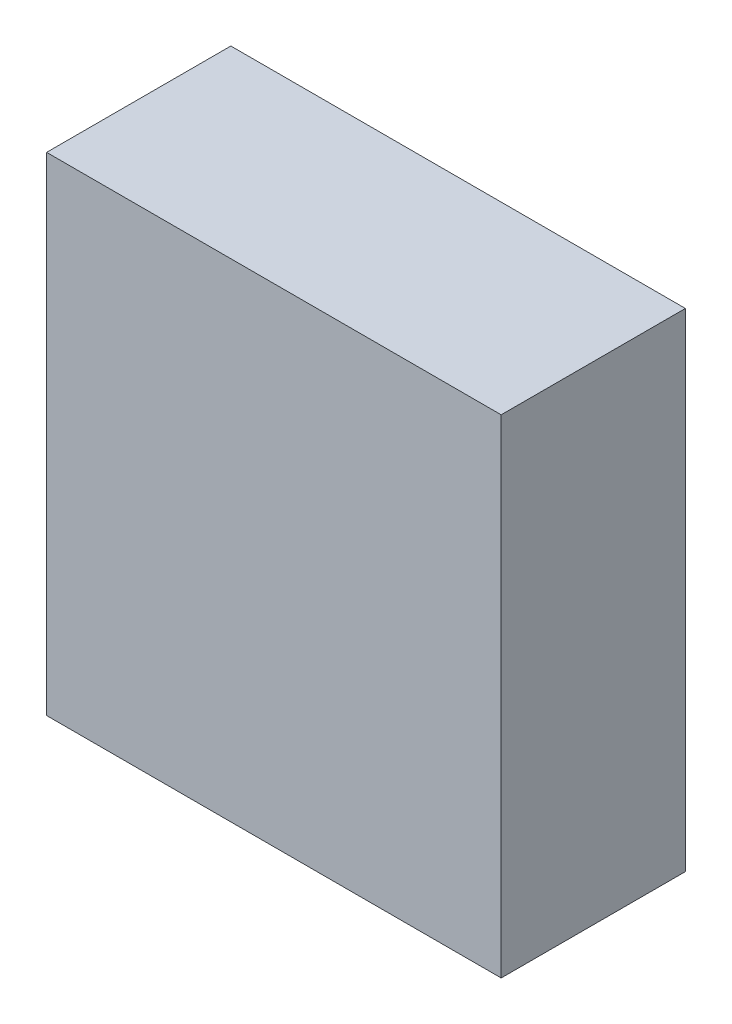
ISO-10303-21;
HEADER;
FILE_DESCRIPTION(('STEP AP214'),'2;1');
FILE_NAME('part.step','',(''),(''),'','','');
FILE_SCHEMA(('AUTOMOTIVE_DESIGN { 1 0 10303 214 1 1 1 1 }'));
ENDSEC;
DATA;
#1=APPLICATION_CONTEXT('core data for automotive mechanical design processes');
#2=APPLICATION_PROTOCOL_DEFINITION('international standard','automotive_design',2000,#1);
#3=PRODUCT_CONTEXT('',#1,'mechanical');
#4=PRODUCT('Part','Part','',(#3));
#5=PRODUCT_RELATED_PRODUCT_CATEGORY('part','',(#4));
#6=PRODUCT_DEFINITION_FORMATION('','',#4);
#7=PRODUCT_DEFINITION_CONTEXT('part definition',#1,'design');
#8=PRODUCT_DEFINITION('design','',#6,#7);
#9=PRODUCT_DEFINITION_SHAPE('','',#8);
#10=(LENGTH_UNIT() NAMED_UNIT(*) SI_UNIT(.MILLI.,.METRE.));
#11=(NAMED_UNIT(*) PLANE_ANGLE_UNIT() SI_UNIT($,.RADIAN.));
#12=(NAMED_UNIT(*) SI_UNIT($,.STERADIAN.) SOLID_ANGLE_UNIT());
#13=UNCERTAINTY_MEASURE_WITH_UNIT(LENGTH_MEASURE(1.E-05),#10,'distance_accuracy_value','');
#14=(GEOMETRIC_REPRESENTATION_CONTEXT(3) GLOBAL_UNCERTAINTY_ASSIGNED_CONTEXT((#13)) GLOBAL_UNIT_ASSIGNED_CONTEXT((#10,
#11,#12)) REPRESENTATION_CONTEXT('',''));
#15=CARTESIAN_POINT('',(0.,0.,0.));
#16=DIRECTION('',(0.,0.,1.));
#17=DIRECTION('',(1.,0.,0.));
#18=AXIS2_PLACEMENT_3D('',#15,#16,#17);
#19=CARTESIAN_POINT('',(-1.60001644388223,3.2699992416654,-4.61112093925476));
#20=DIRECTION('',(-1.,8.74227765734759E-08,0.));
#21=DIRECTION('',(-8.74227765734759E-08,-1.,0.));
#22=AXIS2_PLACEMENT_3D('',#19,#20,#21);
#23=PLANE('',#22);
#24=DIRECTION('',(-8.7422776579626E-08,-0.999999999999996,0.));
#25=VECTOR('',#24,1.);
#26=CARTESIAN_POINT('',(-1.60001644388223,3.2699992416654,-4.61112093925476));
#27=LINE('',#26,#25);
#28=CARTESIAN_POINT('',(-1.60001644388223,3.2699992416654,-4.61112093925476));
#29=VERTEX_POINT('',#28);
#30=CARTESIAN_POINT('',(-1.60001701562726,-3.27000167386194,-4.61112093925476));
#31=VERTEX_POINT('',#30);
#32=EDGE_CURVE('E11',#29,#31,#27,.T.);
#33=ORIENTED_EDGE('',*,*,#32,.T.);
#34=DIRECTION('',(0.,0.,1.));
#35=VECTOR('',#34,1.);
#36=CARTESIAN_POINT('',(-1.60001701562726,-3.27000167386194,-4.61112093925476));
#37=LINE('',#36,#35);
#38=CARTESIAN_POINT('',(-1.60001701562726,-3.27000167386194,-2.14112091064453));
#39=VERTEX_POINT('',#38);
#40=EDGE_CURVE('E88',#31,#39,#37,.T.);
#41=ORIENTED_EDGE('',*,*,#40,.T.);
#42=DIRECTION('',(-8.7422776579626E-08,-0.999999999999996,0.));
#43=VECTOR('',#42,1.);
#44=CARTESIAN_POINT('',(-1.60001644388223,3.2699992416654,-2.14112091064453));
#45=LINE('',#44,#43);
#46=CARTESIAN_POINT('',(-1.60001644388223,3.2699992416654,-2.14112091064453));
#47=VERTEX_POINT('',#46);
#48=EDGE_CURVE('E83',#47,#39,#45,.T.);
#49=ORIENTED_EDGE('',*,*,#48,.F.);
#50=DIRECTION('',(0.,0.,1.));
#51=VECTOR('',#50,1.);
#52=CARTESIAN_POINT('',(-1.60001644388223,3.26999924166541,-4.61112093925476));
#53=LINE('',#52,#51);
#54=EDGE_CURVE('E72',#29,#47,#53,.T.);
#55=ORIENTED_EDGE('',*,*,#54,.F.);
#56=EDGE_LOOP('',(#33,#41,#49,#55));
#57=FACE_BOUND('',#56,.T.);
#58=ADVANCED_FACE('F17',(#57),#23,.T.);
#59=CARTESIAN_POINT('',(-1.60001701562726,-3.27000167386194,-4.61112093925476));
#60=DIRECTION('',(-8.74227765734759E-08,-1.,0.));
#61=DIRECTION('',(1.,-8.74227765734759E-08,0.));
#62=AXIS2_PLACEMENT_3D('',#59,#60,#61);
#63=PLANE('',#62);
#64=DIRECTION('',(0.999999999999996,-8.74227766065619E-08,0.));
#65=VECTOR('',#64,1.);
#66=CARTESIAN_POINT('',(-1.60001701562726,-3.27000167386194,-4.61112093925476));
#67=LINE('',#66,#65);
#68=CARTESIAN_POINT('',(4.49498420507587,-3.27000220670386,-4.61112093925476));
#69=VERTEX_POINT('',#68);
#70=EDGE_CURVE('E24',#31,#69,#67,.T.);
#71=ORIENTED_EDGE('',*,*,#70,.T.);
#72=DIRECTION('',(0.,0.,1.));
#73=VECTOR('',#72,1.);
#74=CARTESIAN_POINT('',(4.49498420507587,-3.27000220670387,-4.61112093925476));
#75=LINE('',#74,#73);
#76=CARTESIAN_POINT('',(4.49498420507587,-3.27000220670386,-2.14112091064453));
#77=VERTEX_POINT('',#76);
#78=EDGE_CURVE('E85',#69,#77,#75,.T.);
#79=ORIENTED_EDGE('',*,*,#78,.T.);
#80=DIRECTION('',(0.999999999999996,-8.74227766065619E-08,0.));
#81=VECTOR('',#80,1.);
#82=CARTESIAN_POINT('',(-1.60001701562726,-3.27000167386194,-2.14112091064453));
#83=LINE('',#82,#81);
#84=EDGE_CURVE('E66',#39,#77,#83,.T.);
#85=ORIENTED_EDGE('',*,*,#84,.F.);
#86=ORIENTED_EDGE('',*,*,#40,.F.);
#87=EDGE_LOOP('',(#71,#79,#85,#86));
#88=FACE_BOUND('',#87,.T.);
#89=ADVANCED_FACE('F89',(#88),#63,.T.);
#90=CARTESIAN_POINT('',(4.49498420507587,-3.27000220670386,-4.61112093925476));
#91=DIRECTION('',(1.,-8.74227765734759E-08,0.));
#92=DIRECTION('',(8.74227765734759E-08,1.,0.));
#93=AXIS2_PLACEMENT_3D('',#90,#91,#92);
#94=PLANE('',#93);
#95=DIRECTION('',(8.7422776579626E-08,0.999999999999996,0.));
#96=VECTOR('',#95,1.);
#97=CARTESIAN_POINT('',(4.49498420507587,-3.27000220670386,-4.61112093925476));
#98=LINE('',#97,#96);
#99=CARTESIAN_POINT('',(4.4949847768209,3.26999870882348,-4.61112093925476));
#100=VERTEX_POINT('',#99);
#101=EDGE_CURVE('E62',#69,#100,#98,.T.);
#102=ORIENTED_EDGE('',*,*,#101,.T.);
#103=DIRECTION('',(0.,0.,1.));
#104=VECTOR('',#103,1.);
#105=CARTESIAN_POINT('',(4.4949847768209,3.26999870882348,-4.61112093925476));
#106=LINE('',#105,#104);
#107=CARTESIAN_POINT('',(4.4949847768209,3.26999870882348,-2.14112091064453));
#108=VERTEX_POINT('',#107);
#109=EDGE_CURVE('E55',#100,#108,#106,.T.);
#110=ORIENTED_EDGE('',*,*,#109,.T.);
#111=DIRECTION('',(8.7422776579626E-08,0.999999999999996,0.));
#112=VECTOR('',#111,1.);
#113=CARTESIAN_POINT('',(4.49498420507587,-3.27000220670386,-2.14112091064453));
#114=LINE('',#113,#112);
#115=EDGE_CURVE('E59',#77,#108,#114,.T.);
#116=ORIENTED_EDGE('',*,*,#115,.F.);
#117=ORIENTED_EDGE('',*,*,#78,.F.);
#118=EDGE_LOOP('',(#102,#110,#116,#117));
#119=FACE_BOUND('',#118,.T.);
#120=ADVANCED_FACE('F57',(#119),#94,.T.);
#121=CARTESIAN_POINT('',(4.4949847768209,3.26999870882348,-4.61112093925476));
#122=DIRECTION('',(8.74227765734759E-08,1.,0.));
#123=DIRECTION('',(-1.,8.74227765734759E-08,0.));
#124=AXIS2_PLACEMENT_3D('',#121,#122,#123);
#125=PLANE('',#124);
#126=DIRECTION('',(-0.999999999999996,8.74227766065619E-08,0.));
#127=VECTOR('',#126,1.);
#128=CARTESIAN_POINT('',(4.4949847768209,3.26999870882348,-4.61112093925476));
#129=LINE('',#128,#127);
#130=EDGE_CURVE('E65',#100,#29,#129,.T.);
#131=ORIENTED_EDGE('',*,*,#130,.T.);
#132=ORIENTED_EDGE('',*,*,#54,.T.);
#133=DIRECTION('',(-0.999999999999996,8.74227766065619E-08,0.));
#134=VECTOR('',#133,1.);
#135=CARTESIAN_POINT('',(4.4949847768209,3.26999870882348,-2.14112091064453));
#136=LINE('',#135,#134);
#137=EDGE_CURVE('E70',#108,#47,#136,.T.);
#138=ORIENTED_EDGE('',*,*,#137,.F.);
#139=ORIENTED_EDGE('',*,*,#109,.F.);
#140=EDGE_LOOP('',(#131,#132,#138,#139));
#141=FACE_BOUND('',#140,.T.);
#142=ADVANCED_FACE('F71',(#141),#125,.T.);
#143=CARTESIAN_POINT('',(464.475006103516,121.549964904785,-2.14112091064453));
#144=DIRECTION('',(0.,0.,1.));
#145=DIRECTION('',(-1.,8.74227765734759E-08,0.));
#146=AXIS2_PLACEMENT_3D('',#143,#144,#145);
#147=PLANE('',#146);
#148=ORIENTED_EDGE('',*,*,#48,.T.);
#149=ORIENTED_EDGE('',*,*,#84,.T.);
#150=ORIENTED_EDGE('',*,*,#115,.T.);
#151=ORIENTED_EDGE('',*,*,#137,.T.);
#152=EDGE_LOOP('',(#148,#149,#150,#151));
#153=FACE_BOUND('',#152,.T.);
#154=ADVANCED_FACE('F76',(#153),#147,.T.);
#155=CARTESIAN_POINT('',(464.475006103516,121.549964904785,-4.61112093925476));
#156=DIRECTION('',(0.,0.,1.));
#157=DIRECTION('',(-1.,8.74227765734759E-08,0.));
#158=AXIS2_PLACEMENT_3D('',#155,#156,#157);
#159=PLANE('',#158);
#160=ORIENTED_EDGE('',*,*,#130,.F.);
#161=ORIENTED_EDGE('',*,*,#101,.F.);
#162=ORIENTED_EDGE('',*,*,#70,.F.);
#163=ORIENTED_EDGE('',*,*,#32,.F.);
#164=EDGE_LOOP('',(#160,#161,#162,#163));
#165=FACE_BOUND('',#164,.T.);
#166=ADVANCED_FACE('F91',(#165),#159,.F.);
#167=CLOSED_SHELL('',(#58,#89,#120,#142,#154,#166));
#168=MANIFOLD_SOLID_BREP('B1',#167);
#169=ADVANCED_BREP_SHAPE_REPRESENTATION('',(#18,#168),#14);
#170=SHAPE_DEFINITION_REPRESENTATION(#9,#169);
ENDSEC;
END-ISO-10303-21;
